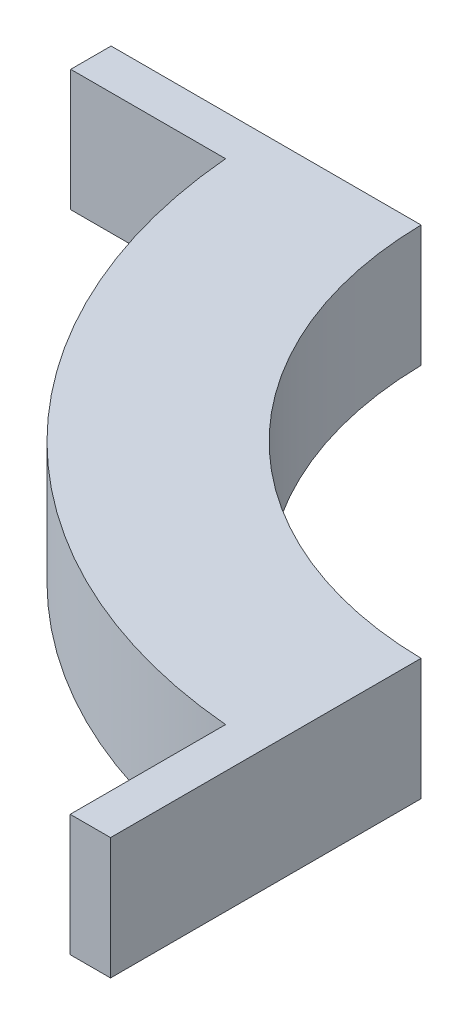
ISO-10303-21;
HEADER;
FILE_DESCRIPTION(('STEP AP214'),'2;1');
FILE_NAME('part.step','',(''),(''),'','','');
FILE_SCHEMA(('AUTOMOTIVE_DESIGN { 1 0 10303 214 1 1 1 1 }'));
ENDSEC;
DATA;
#1=APPLICATION_CONTEXT('core data for automotive mechanical design processes');
#2=APPLICATION_PROTOCOL_DEFINITION('international standard','automotive_design',2000,#1);
#3=PRODUCT_CONTEXT('',#1,'mechanical');
#4=PRODUCT('Part','Part','',(#3));
#5=PRODUCT_RELATED_PRODUCT_CATEGORY('part','',(#4));
#6=PRODUCT_DEFINITION_FORMATION('','',#4);
#7=PRODUCT_DEFINITION_CONTEXT('part definition',#1,'design');
#8=PRODUCT_DEFINITION('design','',#6,#7);
#9=PRODUCT_DEFINITION_SHAPE('','',#8);
#10=(LENGTH_UNIT() NAMED_UNIT(*) SI_UNIT(.MILLI.,.METRE.));
#11=(NAMED_UNIT(*) PLANE_ANGLE_UNIT() SI_UNIT($,.RADIAN.));
#12=(NAMED_UNIT(*) SI_UNIT($,.STERADIAN.) SOLID_ANGLE_UNIT());
#13=UNCERTAINTY_MEASURE_WITH_UNIT(LENGTH_MEASURE(1.E-05),#10,'distance_accuracy_value','');
#14=(GEOMETRIC_REPRESENTATION_CONTEXT(3) GLOBAL_UNCERTAINTY_ASSIGNED_CONTEXT((#13)) GLOBAL_UNIT_ASSIGNED_CONTEXT((#10,
#11,#12)) REPRESENTATION_CONTEXT('',''));
#15=CARTESIAN_POINT('',(0.,0.,0.));
#16=DIRECTION('',(0.,0.,1.));
#17=DIRECTION('',(1.,0.,0.));
#18=AXIS2_PLACEMENT_3D('',#15,#16,#17);
#19=CARTESIAN_POINT('',(0.,50.8,0.));
#20=DIRECTION('',(0.,-1.,0.));
#21=DIRECTION('',(0.,0.,-1.));
#22=AXIS2_PLACEMENT_3D('',#19,#20,#21);
#23=CYLINDRICAL_SURFACE('',#22,159.345101114609);
#24=CARTESIAN_POINT('',(0.,0.,0.));
#25=DIRECTION('',(0.,1.,0.));
#26=DIRECTION('',(0.,0.,1.));
#27=AXIS2_PLACEMENT_3D('',#24,#25,#26);
#28=CIRCLE('',#27,159.345101114609);
#29=CARTESIAN_POINT('',(-159.324855716944,0.,2.54));
#30=VERTEX_POINT('',#29);
#31=CARTESIAN_POINT('',(-2.54,0.,159.324855716944));
#32=VERTEX_POINT('',#31);
#33=EDGE_CURVE('E140',#30,#32,#28,.T.);
#34=ORIENTED_EDGE('',*,*,#33,.F.);
#35=DIRECTION('',(0.,-1.,0.));
#36=VECTOR('',#35,1.);
#37=CARTESIAN_POINT('',(-159.324855716944,50.8,2.54));
#38=LINE('',#37,#36);
#39=CARTESIAN_POINT('',(-159.324855716944,50.8,2.54));
#40=VERTEX_POINT('',#39);
#41=EDGE_CURVE('E11',#40,#30,#38,.T.);
#42=ORIENTED_EDGE('',*,*,#41,.F.);
#43=CARTESIAN_POINT('',(0.,50.8,0.));
#44=DIRECTION('',(0.,1.,0.));
#45=DIRECTION('',(0.,0.,1.));
#46=AXIS2_PLACEMENT_3D('',#43,#44,#45);
#47=CIRCLE('',#46,159.345101114609);
#48=CARTESIAN_POINT('',(-2.54,50.8,159.324855716944));
#49=VERTEX_POINT('',#48);
#50=EDGE_CURVE('E166',#40,#49,#47,.T.);
#51=ORIENTED_EDGE('',*,*,#50,.T.);
#52=DIRECTION('',(0.,-1.,0.));
#53=VECTOR('',#52,1.);
#54=CARTESIAN_POINT('',(-2.54,50.8,159.324855716944));
#55=LINE('',#54,#53);
#56=EDGE_CURVE('E92',#49,#32,#55,.T.);
#57=ORIENTED_EDGE('',*,*,#56,.T.);
#58=EDGE_LOOP('',(#34,#42,#51,#57));
#59=FACE_BOUND('',#58,.T.);
#60=ADVANCED_FACE('F41',(#59),#23,.F.);
#61=CARTESIAN_POINT('',(0.,50.8,2.54));
#62=DIRECTION('',(0.,0.,-1.));
#63=DIRECTION('',(-1.,0.,0.));
#64=AXIS2_PLACEMENT_3D('',#61,#62,#63);
#65=PLANE('',#64);
#66=DIRECTION('',(1.,0.,0.));
#67=VECTOR('',#66,1.);
#68=CARTESIAN_POINT('',(0.,0.,2.54));
#69=LINE('',#68,#67);
#70=CARTESIAN_POINT('',(-288.815722864479,0.,2.54));
#71=VERTEX_POINT('',#70);
#72=EDGE_CURVE('E144',#71,#30,#69,.T.);
#73=ORIENTED_EDGE('',*,*,#72,.F.);
#74=DIRECTION('',(0.,-1.,0.));
#75=VECTOR('',#74,1.);
#76=CARTESIAN_POINT('',(-288.815722864479,50.8,2.54));
#77=LINE('',#76,#75);
#78=CARTESIAN_POINT('',(-288.815722864479,50.8,2.54));
#79=VERTEX_POINT('',#78);
#80=EDGE_CURVE('E50',#79,#71,#77,.T.);
#81=ORIENTED_EDGE('',*,*,#80,.F.);
#82=DIRECTION('',(1.,0.,0.));
#83=VECTOR('',#82,1.);
#84=CARTESIAN_POINT('',(0.,50.8,2.54));
#85=LINE('',#84,#83);
#86=EDGE_CURVE('E205',#79,#40,#85,.T.);
#87=ORIENTED_EDGE('',*,*,#86,.T.);
#88=ORIENTED_EDGE('',*,*,#41,.T.);
#89=EDGE_LOOP('',(#73,#81,#87,#88));
#90=FACE_BOUND('',#89,.T.);
#91=ADVANCED_FACE('F190',(#90),#65,.T.);
#92=CARTESIAN_POINT('',(-288.815722864479,50.8,0.));
#93=DIRECTION('',(-1.,0.,0.));
#94=DIRECTION('',(0.,0.,1.));
#95=AXIS2_PLACEMENT_3D('',#92,#93,#94);
#96=PLANE('',#95);
#97=DIRECTION('',(0.,0.,-1.));
#98=VECTOR('',#97,1.);
#99=CARTESIAN_POINT('',(-288.815722864479,0.,0.));
#100=LINE('',#99,#98);
#101=CARTESIAN_POINT('',(-288.815722864479,0.,19.3982646960224));
#102=VERTEX_POINT('',#101);
#103=EDGE_CURVE('E148',#102,#71,#100,.T.);
#104=ORIENTED_EDGE('',*,*,#103,.F.);
#105=DIRECTION('',(0.,-1.,0.));
#106=VECTOR('',#105,1.);
#107=CARTESIAN_POINT('',(-288.815722864479,50.8,19.3982646960224));
#108=LINE('',#107,#106);
#109=CARTESIAN_POINT('',(-288.815722864479,50.8,19.3982646960224));
#110=VERTEX_POINT('',#109);
#111=EDGE_CURVE('E177',#110,#102,#108,.T.);
#112=ORIENTED_EDGE('',*,*,#111,.F.);
#113=DIRECTION('',(0.,0.,-1.));
#114=VECTOR('',#113,1.);
#115=CARTESIAN_POINT('',(-288.815722864479,50.8,0.));
#116=LINE('',#115,#114);
#117=EDGE_CURVE('E186',#110,#79,#116,.T.);
#118=ORIENTED_EDGE('',*,*,#117,.T.);
#119=ORIENTED_EDGE('',*,*,#80,.T.);
#120=EDGE_LOOP('',(#104,#112,#118,#119));
#121=FACE_BOUND('',#120,.T.);
#122=ADVANCED_FACE('F184',(#121),#96,.T.);
#123=CARTESIAN_POINT('',(0.,50.8,19.3982646960224));
#124=DIRECTION('',(0.,0.,-1.));
#125=DIRECTION('',(-1.,0.,0.));
#126=AXIS2_PLACEMENT_3D('',#123,#124,#125);
#127=PLANE('',#126);
#128=DIRECTION('',(1.,0.,0.));
#129=VECTOR('',#128,1.);
#130=CARTESIAN_POINT('',(0.,0.,19.3982646960224));
#131=LINE('',#130,#129);
#132=CARTESIAN_POINT('',(-224.124430379448,0.,19.3982646960224));
#133=VERTEX_POINT('',#132);
#134=EDGE_CURVE('E152',#102,#133,#131,.T.);
#135=ORIENTED_EDGE('',*,*,#134,.T.);
#136=DIRECTION('',(0.,-1.,0.));
#137=VECTOR('',#136,1.);
#138=CARTESIAN_POINT('',(-224.124430379448,50.8,19.3982646960224));
#139=LINE('',#138,#137);
#140=CARTESIAN_POINT('',(-224.124430379448,50.8,19.3982646960224));
#141=VERTEX_POINT('',#140);
#142=EDGE_CURVE('E173',#141,#133,#139,.T.);
#143=ORIENTED_EDGE('',*,*,#142,.F.);
#144=DIRECTION('',(1.,0.,0.));
#145=VECTOR('',#144,1.);
#146=CARTESIAN_POINT('',(0.,50.8,19.3982646960224));
#147=LINE('',#146,#145);
#148=EDGE_CURVE('E134',#110,#141,#147,.T.);
#149=ORIENTED_EDGE('',*,*,#148,.F.);
#150=ORIENTED_EDGE('',*,*,#111,.T.);
#151=EDGE_LOOP('',(#135,#143,#149,#150));
#152=FACE_BOUND('',#151,.T.);
#153=ADVANCED_FACE('F197',(#152),#127,.F.);
#154=CARTESIAN_POINT('',(0.,50.8,0.));
#155=DIRECTION('',(0.,-1.,0.));
#156=DIRECTION('',(0.,0.,-1.));
#157=AXIS2_PLACEMENT_3D('',#154,#155,#156);
#158=CYLINDRICAL_SURFACE('',#157,224.962336772468);
#159=CARTESIAN_POINT('',(0.,0.,0.));
#160=DIRECTION('',(0.,1.,0.));
#161=DIRECTION('',(0.,0.,1.));
#162=AXIS2_PLACEMENT_3D('',#159,#160,#161);
#163=CIRCLE('',#162,224.962336772468);
#164=CARTESIAN_POINT('',(-19.3982646960224,0.,224.124430379448));
#165=VERTEX_POINT('',#164);
#166=EDGE_CURVE('E155',#133,#165,#163,.T.);
#167=ORIENTED_EDGE('',*,*,#166,.T.);
#168=DIRECTION('',(0.,-1.,0.));
#169=VECTOR('',#168,1.);
#170=CARTESIAN_POINT('',(-19.3982646960224,50.8,224.124430379448));
#171=LINE('',#170,#169);
#172=CARTESIAN_POINT('',(-19.3982646960224,50.8,224.124430379448));
#173=VERTEX_POINT('',#172);
#174=EDGE_CURVE('E120',#173,#165,#171,.T.);
#175=ORIENTED_EDGE('',*,*,#174,.F.);
#176=CARTESIAN_POINT('',(0.,50.8,0.));
#177=DIRECTION('',(0.,1.,0.));
#178=DIRECTION('',(0.,0.,1.));
#179=AXIS2_PLACEMENT_3D('',#176,#177,#178);
#180=CIRCLE('',#179,224.962336772468);
#181=EDGE_CURVE('E129',#141,#173,#180,.T.);
#182=ORIENTED_EDGE('',*,*,#181,.F.);
#183=ORIENTED_EDGE('',*,*,#142,.T.);
#184=EDGE_LOOP('',(#167,#175,#182,#183));
#185=FACE_BOUND('',#184,.T.);
#186=ADVANCED_FACE('F200',(#185),#158,.T.);
#187=CARTESIAN_POINT('',(-19.3982646960224,50.8,0.));
#188=DIRECTION('',(-1.,0.,0.));
#189=DIRECTION('',(0.,0.,1.));
#190=AXIS2_PLACEMENT_3D('',#187,#188,#189);
#191=PLANE('',#190);
#192=DIRECTION('',(0.,0.,-1.));
#193=VECTOR('',#192,1.);
#194=CARTESIAN_POINT('',(-19.3982646960224,0.,0.));
#195=LINE('',#194,#193);
#196=CARTESIAN_POINT('',(-19.3982646960224,0.,289.040694823116));
#197=VERTEX_POINT('',#196);
#198=EDGE_CURVE('E118',#197,#165,#195,.T.);
#199=ORIENTED_EDGE('',*,*,#198,.F.);
#200=DIRECTION('',(0.,-1.,0.));
#201=VECTOR('',#200,1.);
#202=CARTESIAN_POINT('',(-19.3982646960224,50.8,289.040694823116));
#203=LINE('',#202,#201);
#204=CARTESIAN_POINT('',(-19.3982646960224,50.8,289.040694823116));
#205=VERTEX_POINT('',#204);
#206=EDGE_CURVE('E112',#205,#197,#203,.T.);
#207=ORIENTED_EDGE('',*,*,#206,.F.);
#208=DIRECTION('',(0.,0.,-1.));
#209=VECTOR('',#208,1.);
#210=CARTESIAN_POINT('',(-19.3982646960224,50.8,0.));
#211=LINE('',#210,#209);
#212=EDGE_CURVE('E116',#205,#173,#211,.T.);
#213=ORIENTED_EDGE('',*,*,#212,.T.);
#214=ORIENTED_EDGE('',*,*,#174,.T.);
#215=EDGE_LOOP('',(#199,#207,#213,#214));
#216=FACE_BOUND('',#215,.T.);
#217=ADVANCED_FACE('F114',(#216),#191,.T.);
#218=CARTESIAN_POINT('',(0.,50.8,289.040694823116));
#219=DIRECTION('',(0.,0.,-1.));
#220=DIRECTION('',(-1.,0.,0.));
#221=AXIS2_PLACEMENT_3D('',#218,#219,#220);
#222=PLANE('',#221);
#223=DIRECTION('',(1.,0.,0.));
#224=VECTOR('',#223,1.);
#225=CARTESIAN_POINT('',(0.,0.,289.040694823116));
#226=LINE('',#225,#224);
#227=CARTESIAN_POINT('',(-2.54,0.,289.040694823116));
#228=VERTEX_POINT('',#227);
#229=EDGE_CURVE('E85',#197,#228,#226,.T.);
#230=ORIENTED_EDGE('',*,*,#229,.T.);
#231=DIRECTION('',(0.,-1.,0.));
#232=VECTOR('',#231,1.);
#233=CARTESIAN_POINT('',(-2.54,50.8,289.040694823116));
#234=LINE('',#233,#232);
#235=CARTESIAN_POINT('',(-2.54,50.8,289.040694823116));
#236=VERTEX_POINT('',#235);
#237=EDGE_CURVE('E121',#236,#228,#234,.T.);
#238=ORIENTED_EDGE('',*,*,#237,.F.);
#239=DIRECTION('',(1.,0.,0.));
#240=VECTOR('',#239,1.);
#241=CARTESIAN_POINT('',(0.,50.8,289.040694823116));
#242=LINE('',#241,#240);
#243=EDGE_CURVE('E123',#205,#236,#242,.T.);
#244=ORIENTED_EDGE('',*,*,#243,.F.);
#245=ORIENTED_EDGE('',*,*,#206,.T.);
#246=EDGE_LOOP('',(#230,#238,#244,#245));
#247=FACE_BOUND('',#246,.T.);
#248=ADVANCED_FACE('F124',(#247),#222,.F.);
#249=CARTESIAN_POINT('',(-2.54,50.8,0.));
#250=DIRECTION('',(-1.,0.,0.));
#251=DIRECTION('',(0.,0.,1.));
#252=AXIS2_PLACEMENT_3D('',#249,#250,#251);
#253=PLANE('',#252);
#254=DIRECTION('',(0.,0.,-1.));
#255=VECTOR('',#254,1.);
#256=CARTESIAN_POINT('',(-2.54,0.,0.));
#257=LINE('',#256,#255);
#258=EDGE_CURVE('E163',#228,#32,#257,.T.);
#259=ORIENTED_EDGE('',*,*,#258,.T.);
#260=ORIENTED_EDGE('',*,*,#56,.F.);
#261=DIRECTION('',(0.,0.,-1.));
#262=VECTOR('',#261,1.);
#263=CARTESIAN_POINT('',(-2.54,50.8,0.));
#264=LINE('',#263,#262);
#265=EDGE_CURVE('E58',#236,#49,#264,.T.);
#266=ORIENTED_EDGE('',*,*,#265,.F.);
#267=ORIENTED_EDGE('',*,*,#237,.T.);
#268=EDGE_LOOP('',(#259,#260,#266,#267));
#269=FACE_BOUND('',#268,.T.);
#270=ADVANCED_FACE('F203',(#269),#253,.F.);
#271=CARTESIAN_POINT('',(0.,50.8,0.));
#272=DIRECTION('',(0.,1.,0.));
#273=DIRECTION('',(0.,0.,1.));
#274=AXIS2_PLACEMENT_3D('',#271,#272,#273);
#275=PLANE('',#274);
#276=ORIENTED_EDGE('',*,*,#50,.F.);
#277=ORIENTED_EDGE('',*,*,#86,.F.);
#278=ORIENTED_EDGE('',*,*,#117,.F.);
#279=ORIENTED_EDGE('',*,*,#148,.T.);
#280=ORIENTED_EDGE('',*,*,#181,.T.);
#281=ORIENTED_EDGE('',*,*,#212,.F.);
#282=ORIENTED_EDGE('',*,*,#243,.T.);
#283=ORIENTED_EDGE('',*,*,#265,.T.);
#284=EDGE_LOOP('',(#276,#277,#278,#279,#280,#281,#282,#283));
#285=FACE_BOUND('',#284,.T.);
#286=ADVANCED_FACE('F127',(#285),#275,.T.);
#287=CARTESIAN_POINT('',(0.,0.,0.));
#288=DIRECTION('',(0.,1.,0.));
#289=DIRECTION('',(0.,0.,1.));
#290=AXIS2_PLACEMENT_3D('',#287,#288,#289);
#291=PLANE('',#290);
#292=ORIENTED_EDGE('',*,*,#33,.T.);
#293=ORIENTED_EDGE('',*,*,#258,.F.);
#294=ORIENTED_EDGE('',*,*,#229,.F.);
#295=ORIENTED_EDGE('',*,*,#198,.T.);
#296=ORIENTED_EDGE('',*,*,#166,.F.);
#297=ORIENTED_EDGE('',*,*,#134,.F.);
#298=ORIENTED_EDGE('',*,*,#103,.T.);
#299=ORIENTED_EDGE('',*,*,#72,.T.);
#300=EDGE_LOOP('',(#292,#293,#294,#295,#296,#297,#298,#299));
#301=FACE_BOUND('',#300,.T.);
#302=ADVANCED_FACE('F193',(#301),#291,.F.);
#303=CLOSED_SHELL('',(#60,#91,#122,#153,#186,#217,#248,#270,#286,#302));
#304=MANIFOLD_SOLID_BREP('B2',#303);
#305=ADVANCED_BREP_SHAPE_REPRESENTATION('',(#18,#304),#14);
#306=SHAPE_DEFINITION_REPRESENTATION(#9,#305);
ENDSEC;
END-ISO-10303-21;
